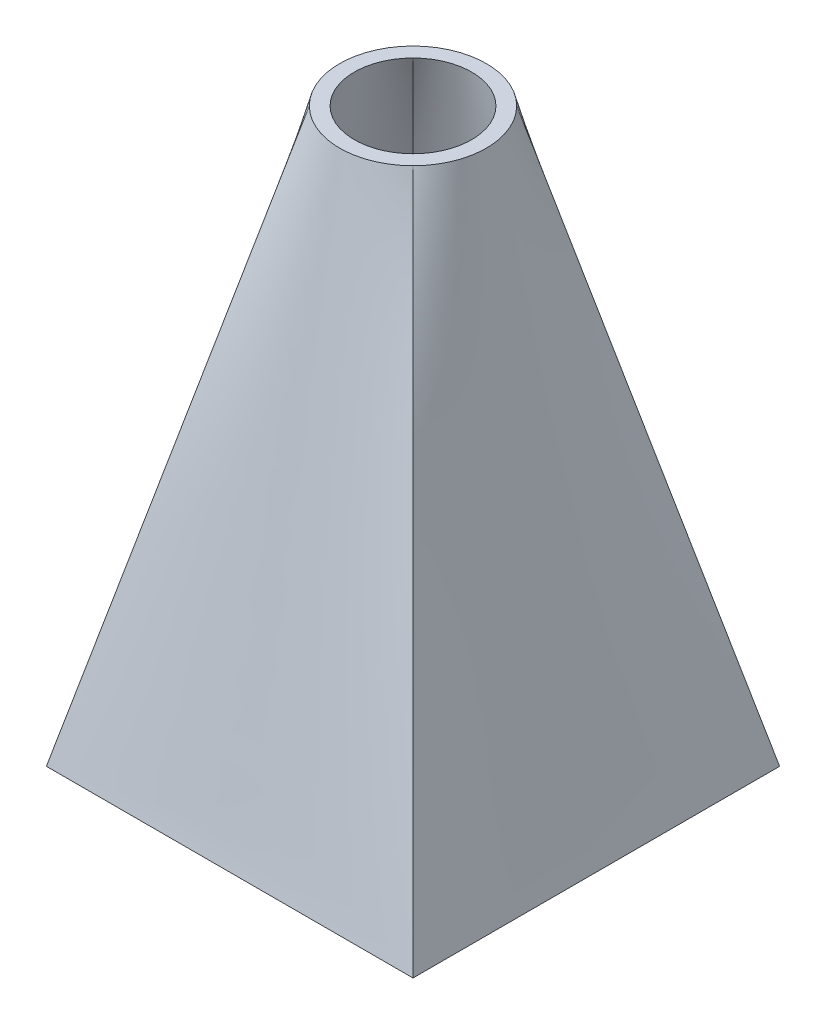
ISO-10303-21;
HEADER;
FILE_DESCRIPTION(('STEP AP214'),'2;1');
FILE_NAME('part.step','',(''),(''),'','','');
FILE_SCHEMA(('AUTOMOTIVE_DESIGN { 1 0 10303 214 1 1 1 1 }'));
ENDSEC;
DATA;
#1=APPLICATION_CONTEXT('core data for automotive mechanical design processes');
#2=APPLICATION_PROTOCOL_DEFINITION('international standard','automotive_design',2000,#1);
#3=PRODUCT_CONTEXT('',#1,'mechanical');
#4=PRODUCT('Part','Part','',(#3));
#5=PRODUCT_RELATED_PRODUCT_CATEGORY('part','',(#4));
#6=PRODUCT_DEFINITION_FORMATION('','',#4);
#7=PRODUCT_DEFINITION_CONTEXT('part definition',#1,'design');
#8=PRODUCT_DEFINITION('design','',#6,#7);
#9=PRODUCT_DEFINITION_SHAPE('','',#8);
#10=(LENGTH_UNIT() NAMED_UNIT(*) SI_UNIT(.MILLI.,.METRE.));
#11=(NAMED_UNIT(*) PLANE_ANGLE_UNIT() SI_UNIT($,.RADIAN.));
#12=(NAMED_UNIT(*) SI_UNIT($,.STERADIAN.) SOLID_ANGLE_UNIT());
#13=UNCERTAINTY_MEASURE_WITH_UNIT(LENGTH_MEASURE(1.E-05),#10,'distance_accuracy_value','');
#14=(GEOMETRIC_REPRESENTATION_CONTEXT(3) GLOBAL_UNCERTAINTY_ASSIGNED_CONTEXT((#13)) GLOBAL_UNIT_ASSIGNED_CONTEXT((#10,
#11,#12)) REPRESENTATION_CONTEXT('',''));
#15=CARTESIAN_POINT('',(0.,0.,0.));
#16=DIRECTION('',(0.,0.,1.));
#17=DIRECTION('',(1.,0.,0.));
#18=AXIS2_PLACEMENT_3D('',#15,#16,#17);
#19=CARTESIAN_POINT('',(0.,0.,0.));
#20=DIRECTION('',(0.,1.,0.));
#21=DIRECTION('',(0.,0.,1.));
#22=AXIS2_PLACEMENT_3D('',#19,#20,#21);
#23=PLANE('',#22);
#24=CARTESIAN_POINT('',(0.,0.,0.));
#25=DIRECTION('',(0.,1.,0.));
#26=DIRECTION('',(0.,0.,1.));
#27=AXIS2_PLACEMENT_3D('',#24,#25,#26);
#28=CIRCLE('',#27,4.);
#29=CARTESIAN_POINT('',(-2.82842712474619,0.,2.82842712474619));
#30=VERTEX_POINT('',#29);
#31=CARTESIAN_POINT('',(2.82842712474619,0.,2.82842712474619));
#32=VERTEX_POINT('',#31);
#33=EDGE_CURVE('E275',#30,#32,#28,.T.);
#34=ORIENTED_EDGE('',*,*,#33,.F.);
#35=CARTESIAN_POINT('',(-2.82842712474619,0.,-2.82842712474619));
#36=VERTEX_POINT('',#35);
#37=EDGE_CURVE('E294',#36,#30,#28,.T.);
#38=ORIENTED_EDGE('',*,*,#37,.F.);
#39=CARTESIAN_POINT('',(2.82842712474619,0.,-2.82842712474619));
#40=VERTEX_POINT('',#39);
#41=EDGE_CURVE('E253',#40,#36,#28,.T.);
#42=ORIENTED_EDGE('',*,*,#41,.F.);
#43=EDGE_CURVE('E93',#32,#40,#28,.T.);
#44=ORIENTED_EDGE('',*,*,#43,.F.);
#45=EDGE_LOOP('',(#34,#38,#42,#44));
#46=FACE_BOUND('',#45,.T.);
#47=CARTESIAN_POINT('',(0.,0.,0.));
#48=DIRECTION('',(0.,1.,0.));
#49=DIRECTION('',(0.,0.,1.));
#50=AXIS2_PLACEMENT_3D('',#47,#48,#49);
#51=CIRCLE('',#50,5.);
#52=CARTESIAN_POINT('',(3.53553390593274,0.,3.53553390593274));
#53=VERTEX_POINT('',#52);
#54=CARTESIAN_POINT('',(3.53553390593274,0.,-3.53553390593274));
#55=VERTEX_POINT('',#54);
#56=EDGE_CURVE('E12',#53,#55,#51,.T.);
#57=ORIENTED_EDGE('',*,*,#56,.T.);
#58=CARTESIAN_POINT('',(-3.53553390593274,0.,-3.53553390593274));
#59=VERTEX_POINT('',#58);
#60=EDGE_CURVE('E99',#55,#59,#51,.T.);
#61=ORIENTED_EDGE('',*,*,#60,.T.);
#62=CARTESIAN_POINT('',(-3.53553390593274,0.,3.53553390593274));
#63=VERTEX_POINT('',#62);
#64=EDGE_CURVE('E463',#59,#63,#51,.T.);
#65=ORIENTED_EDGE('',*,*,#64,.T.);
#66=EDGE_CURVE('E454',#63,#53,#51,.T.);
#67=ORIENTED_EDGE('',*,*,#66,.T.);
#68=EDGE_LOOP('',(#57,#61,#65,#67));
#69=FACE_BOUND('',#68,.T.);
#70=ADVANCED_FACE('F89',(#46,#69),#23,.T.);
#71=CARTESIAN_POINT('',(0.,-39.,0.));
#72=DIRECTION('',(0.,1.,0.));
#73=DIRECTION('',(0.,0.,1.));
#74=AXIS2_PLACEMENT_3D('',#71,#72,#73);
#75=PLANE('',#74);
#76=DIRECTION('',(0.,0.,1.));
#77=VECTOR('',#76,1.);
#78=CARTESIAN_POINT('',(-11.,-39.,-11.));
#79=LINE('',#78,#77);
#80=CARTESIAN_POINT('',(-11.,-39.,-11.));
#81=VERTEX_POINT('',#80);
#82=CARTESIAN_POINT('',(-11.,-39.,11.));
#83=VERTEX_POINT('',#82);
#84=EDGE_CURVE('E115',#81,#83,#79,.T.);
#85=ORIENTED_EDGE('',*,*,#84,.T.);
#86=DIRECTION('',(1.,0.,0.));
#87=VECTOR('',#86,1.);
#88=CARTESIAN_POINT('',(-11.,-39.,11.));
#89=LINE('',#88,#87);
#90=CARTESIAN_POINT('',(11.,-39.,11.));
#91=VERTEX_POINT('',#90);
#92=EDGE_CURVE('E182',#83,#91,#89,.T.);
#93=ORIENTED_EDGE('',*,*,#92,.T.);
#94=DIRECTION('',(0.,0.,-1.));
#95=VECTOR('',#94,1.);
#96=CARTESIAN_POINT('',(11.,-39.,-11.));
#97=LINE('',#96,#95);
#98=CARTESIAN_POINT('',(11.,-39.,-11.));
#99=VERTEX_POINT('',#98);
#100=EDGE_CURVE('E165',#91,#99,#97,.T.);
#101=ORIENTED_EDGE('',*,*,#100,.T.);
#102=DIRECTION('',(-1.,0.,0.));
#103=VECTOR('',#102,1.);
#104=CARTESIAN_POINT('',(-11.,-39.,-11.));
#105=LINE('',#104,#103);
#106=EDGE_CURVE('E157',#99,#81,#105,.T.);
#107=ORIENTED_EDGE('',*,*,#106,.T.);
#108=EDGE_LOOP('',(#85,#93,#101,#107));
#109=FACE_BOUND('',#108,.T.);
#110=DIRECTION('',(0.,0.,1.));
#111=VECTOR('',#110,1.);
#112=CARTESIAN_POINT('',(-12.5,-39.,-12.5));
#113=LINE('',#112,#111);
#114=CARTESIAN_POINT('',(-12.5,-39.,-12.5));
#115=VERTEX_POINT('',#114);
#116=CARTESIAN_POINT('',(-12.5,-39.,12.5));
#117=VERTEX_POINT('',#116);
#118=EDGE_CURVE('E368',#115,#117,#113,.T.);
#119=ORIENTED_EDGE('',*,*,#118,.F.);
#120=DIRECTION('',(1.,0.,0.));
#121=VECTOR('',#120,1.);
#122=CARTESIAN_POINT('',(-12.5,-39.,-12.5));
#123=LINE('',#122,#121);
#124=CARTESIAN_POINT('',(12.5,-39.,-12.5));
#125=VERTEX_POINT('',#124);
#126=EDGE_CURVE('E385',#115,#125,#123,.T.);
#127=ORIENTED_EDGE('',*,*,#126,.T.);
#128=DIRECTION('',(0.,0.,1.));
#129=VECTOR('',#128,1.);
#130=CARTESIAN_POINT('',(12.5,-39.,-12.5));
#131=LINE('',#130,#129);
#132=CARTESIAN_POINT('',(12.5,-39.,12.5));
#133=VERTEX_POINT('',#132);
#134=EDGE_CURVE('E378',#125,#133,#131,.T.);
#135=ORIENTED_EDGE('',*,*,#134,.T.);
#136=DIRECTION('',(1.,0.,0.));
#137=VECTOR('',#136,1.);
#138=CARTESIAN_POINT('',(-12.5,-39.,12.5));
#139=LINE('',#138,#137);
#140=EDGE_CURVE('E370',#117,#133,#139,.T.);
#141=ORIENTED_EDGE('',*,*,#140,.F.);
#142=EDGE_LOOP('',(#119,#127,#135,#141));
#143=FACE_BOUND('',#142,.T.);
#144=ADVANCED_FACE('F180',(#109,#143),#75,.F.);
#145=CARTESIAN_POINT('',(12.5,-39.,-12.5));
#146=CARTESIAN_POINT('',(3.53553390593274,0.,-3.53553390593274));
#147=CARTESIAN_POINT('',(10.4166666666667,-39.,-12.5));
#148=CARTESIAN_POINT('',(3.11886723926607,0.,-3.9522005725994));
#149=CARTESIAN_POINT('',(8.33333333333333,-39.,-12.5));
#150=CARTESIAN_POINT('',(2.59339721214962,0.,-4.32579298105229));
#151=CARTESIAN_POINT('',(5.20833333333333,-39.,-12.5));
#152=CARTESIAN_POINT('',(1.68213150016822,0.,-4.72016759446828));
#153=CARTESIAN_POINT('',(4.16666666666666,-39.,-12.5));
#154=CARTESIAN_POINT('',(1.35881651527707,0.,-4.82392482457469));
#155=CARTESIAN_POINT('',(2.08333333333333,-39.,-12.5));
#156=CARTESIAN_POINT('',(0.690278229276497,0.,-4.96388446697993));
#157=CARTESIAN_POINT('',(1.04166666666666,-39.,-12.5));
#158=CARTESIAN_POINT('',(0.345177968644245,0.,-5.));
#159=CARTESIAN_POINT('',(-1.04166666666667,-39.,-12.5));
#160=CARTESIAN_POINT('',(-0.345177968644246,0.,-5.));
#161=CARTESIAN_POINT('',(-2.08333333333334,-39.,-12.5));
#162=CARTESIAN_POINT('',(-0.690278229276498,0.,-4.96388446697993));
#163=CARTESIAN_POINT('',(-4.16666666666667,-39.,-12.5));
#164=CARTESIAN_POINT('',(-1.35881651527707,0.,-4.82392482457469));
#165=CARTESIAN_POINT('',(-5.20833333333334,-39.,-12.5));
#166=CARTESIAN_POINT('',(-1.68213150016822,0.,-4.72016759446828));
#167=CARTESIAN_POINT('',(-8.33333333333334,-39.,-12.5));
#168=CARTESIAN_POINT('',(-2.59339721214962,0.,-4.32579298105229));
#169=CARTESIAN_POINT('',(-10.4166666666667,-39.,-12.5));
#170=CARTESIAN_POINT('',(-3.11886723926607,0.,-3.95220057259941));
#171=CARTESIAN_POINT('',(-12.5,-39.,-12.5));
#172=CARTESIAN_POINT('',(-3.53553390593274,0.,-3.53553390593274));
#173=B_SPLINE_SURFACE_WITH_KNOTS('',3,1,((#145,#146),(#147,#148),(#149,#150),(#151,#152),(#153,
#154),(#155,#156),(#157,#158),(#159,#160),(#161,#162),(#163,#164),(#165,#166),(#167,#168),(#169,
#170),(#171,#172)),.UNSPECIFIED.,.F.,.F.,.F.,(4,2,2,2,2,2,4),(2,2),(0.,0.25,0.375,0.5,0.625,
0.75,1.),(0.,1.),.UNSPECIFIED.);
#174=DIRECTION('',(0.218598490006613,0.951014931709097,0.218598490006613));
#175=VECTOR('',#174,1.);
#176=CARTESIAN_POINT('',(-8.01776695296637,-19.5,-8.01776695296637));
#177=LINE('',#176,#175);
#178=EDGE_CURVE('E404',#115,#59,#177,.T.);
#179=DIRECTION('',(0.218598490006612,-0.951014931709097,-0.218598490006613));
#180=VECTOR('',#179,1.);
#181=CARTESIAN_POINT('',(8.01776695296636,-19.5,-8.01776695296637));
#182=LINE('',#181,#180);
#183=EDGE_CURVE('E390',#55,#125,#182,.T.);
#184=ORIENTED_EDGE('',*,*,#126,.F.);
#185=ORIENTED_EDGE('',*,*,#178,.T.);
#186=ORIENTED_EDGE('',*,*,#60,.F.);
#187=ORIENTED_EDGE('',*,*,#183,.T.);
#188=EDGE_LOOP('',(#184,#185,#186,#187));
#189=FACE_BOUND('',#188,.T.);
#190=ADVANCED_FACE('F203',(#189),#173,.T.);
#191=CARTESIAN_POINT('',(-12.5,-39.,-12.5));
#192=CARTESIAN_POINT('',(-3.53553390593274,0.,-3.53553390593274));
#193=CARTESIAN_POINT('',(-12.5,-39.,-10.4166666666667));
#194=CARTESIAN_POINT('',(-3.9522005725994,0.,-3.11886723926607));
#195=CARTESIAN_POINT('',(-12.5,-39.,-8.33333333333334));
#196=CARTESIAN_POINT('',(-4.32579298105229,0.,-2.59339721214962));
#197=CARTESIAN_POINT('',(-12.5,-39.,-5.20833333333334));
#198=CARTESIAN_POINT('',(-4.72016759446828,0.,-1.68213150016822));
#199=CARTESIAN_POINT('',(-12.5,-39.,-4.16666666666667));
#200=CARTESIAN_POINT('',(-4.82392482457469,0.,-1.35881651527707));
#201=CARTESIAN_POINT('',(-12.5,-39.,-2.08333333333334));
#202=CARTESIAN_POINT('',(-4.96388446697993,0.,-0.690278229276499));
#203=CARTESIAN_POINT('',(-12.5,-39.,-1.04166666666667));
#204=CARTESIAN_POINT('',(-5.,0.,-0.345177968644247));
#205=CARTESIAN_POINT('',(-12.5,-39.,1.04166666666666));
#206=CARTESIAN_POINT('',(-5.,0.,0.345177968644245));
#207=CARTESIAN_POINT('',(-12.5,-39.,2.08333333333333));
#208=CARTESIAN_POINT('',(-4.96388446697993,0.,0.690278229276497));
#209=CARTESIAN_POINT('',(-12.5,-39.,4.16666666666666));
#210=CARTESIAN_POINT('',(-4.82392482457469,0.,1.35881651527707));
#211=CARTESIAN_POINT('',(-12.5,-39.,5.20833333333333));
#212=CARTESIAN_POINT('',(-4.72016759446828,0.,1.68213150016822));
#213=CARTESIAN_POINT('',(-12.5,-39.,8.33333333333333));
#214=CARTESIAN_POINT('',(-4.32579298105229,0.,2.59339721214962));
#215=CARTESIAN_POINT('',(-12.5,-39.,10.4166666666667));
#216=CARTESIAN_POINT('',(-3.9522005725994,0.,3.11886723926607));
#217=CARTESIAN_POINT('',(-12.5,-39.,12.5));
#218=CARTESIAN_POINT('',(-3.53553390593274,0.,3.53553390593274));
#219=B_SPLINE_SURFACE_WITH_KNOTS('',3,1,((#191,#192),(#193,#194),(#195,#196),(#197,#198),(#199,
#200),(#201,#202),(#203,#204),(#205,#206),(#207,#208),(#209,#210),(#211,#212),(#213,#214),(#215,
#216),(#217,#218)),.UNSPECIFIED.,.F.,.F.,.F.,(4,2,2,2,2,2,4),(2,2),(0.,0.25,0.375,0.5,0.625,
0.75,1.),(0.,1.),.UNSPECIFIED.);
#220=DIRECTION('',(0.218598490006612,0.951014931709097,-0.218598490006613));
#221=VECTOR('',#220,1.);
#222=CARTESIAN_POINT('',(-8.01776695296637,-19.5,8.01776695296637));
#223=LINE('',#222,#221);
#224=EDGE_CURVE('E406',#117,#63,#223,.T.);
#225=ORIENTED_EDGE('',*,*,#118,.T.);
#226=ORIENTED_EDGE('',*,*,#224,.T.);
#227=ORIENTED_EDGE('',*,*,#64,.F.);
#228=ORIENTED_EDGE('',*,*,#178,.F.);
#229=EDGE_LOOP('',(#225,#226,#227,#228));
#230=FACE_BOUND('',#229,.T.);
#231=ADVANCED_FACE('F420',(#230),#219,.T.);
#232=CARTESIAN_POINT('',(12.5,-39.,12.5));
#233=CARTESIAN_POINT('',(3.53553390593274,0.,3.53553390593274));
#234=CARTESIAN_POINT('',(12.5,-39.,10.4166666666667));
#235=CARTESIAN_POINT('',(3.9522005725994,0.,3.11886723926607));
#236=CARTESIAN_POINT('',(12.5,-39.,8.33333333333333));
#237=CARTESIAN_POINT('',(4.32579298105229,0.,2.59339721214962));
#238=CARTESIAN_POINT('',(12.5,-39.,5.20833333333333));
#239=CARTESIAN_POINT('',(4.72016759446828,0.,1.68213150016822));
#240=CARTESIAN_POINT('',(12.5,-39.,4.16666666666666));
#241=CARTESIAN_POINT('',(4.82392482457469,0.,1.35881651527707));
#242=CARTESIAN_POINT('',(12.5,-39.,2.08333333333333));
#243=CARTESIAN_POINT('',(4.96388446697993,0.,0.690278229276497));
#244=CARTESIAN_POINT('',(12.5,-39.,1.04166666666667));
#245=CARTESIAN_POINT('',(5.,0.,0.345177968644246));
#246=CARTESIAN_POINT('',(12.5,-39.,-1.04166666666667));
#247=CARTESIAN_POINT('',(5.,0.,-0.345177968644246));
#248=CARTESIAN_POINT('',(12.5,-39.,-2.08333333333334));
#249=CARTESIAN_POINT('',(4.96388446697993,0.,-0.690278229276499));
#250=CARTESIAN_POINT('',(12.5,-39.,-4.16666666666667));
#251=CARTESIAN_POINT('',(4.82392482457469,0.,-1.35881651527707));
#252=CARTESIAN_POINT('',(12.5,-39.,-5.20833333333334));
#253=CARTESIAN_POINT('',(4.72016759446828,0.,-1.68213150016822));
#254=CARTESIAN_POINT('',(12.5,-39.,-8.33333333333334));
#255=CARTESIAN_POINT('',(4.32579298105229,0.,-2.59339721214962));
#256=CARTESIAN_POINT('',(12.5,-39.,-10.4166666666667));
#257=CARTESIAN_POINT('',(3.9522005725994,0.,-3.11886723926607));
#258=CARTESIAN_POINT('',(12.5,-39.,-12.5));
#259=CARTESIAN_POINT('',(3.53553390593274,0.,-3.53553390593274));
#260=B_SPLINE_SURFACE_WITH_KNOTS('',3,1,((#232,#233),(#234,#235),(#236,#237),(#238,#239),(#240,
#241),(#242,#243),(#244,#245),(#246,#247),(#248,#249),(#250,#251),(#252,#253),(#254,#255),(#256,
#257),(#258,#259)),.UNSPECIFIED.,.F.,.F.,.F.,(4,2,2,2,2,2,4),(2,2),(0.,0.25,0.375,0.5,0.625,
0.75,1.),(0.,1.),.UNSPECIFIED.);
#261=DIRECTION('',(-0.218598490006613,0.951014931709097,-0.218598490006613));
#262=VECTOR('',#261,1.);
#263=CARTESIAN_POINT('',(8.01776695296637,-19.5,8.01776695296637));
#264=LINE('',#263,#262);
#265=EDGE_CURVE('E398',#133,#53,#264,.T.);
#266=ORIENTED_EDGE('',*,*,#134,.F.);
#267=ORIENTED_EDGE('',*,*,#183,.F.);
#268=ORIENTED_EDGE('',*,*,#56,.F.);
#269=ORIENTED_EDGE('',*,*,#265,.F.);
#270=EDGE_LOOP('',(#266,#267,#268,#269));
#271=FACE_BOUND('',#270,.T.);
#272=ADVANCED_FACE('F396',(#271),#260,.T.);
#273=CARTESIAN_POINT('',(-12.5,-39.,12.5));
#274=CARTESIAN_POINT('',(-3.53553390593274,0.,3.53553390593274));
#275=CARTESIAN_POINT('',(-10.4166666666667,-39.,12.5));
#276=CARTESIAN_POINT('',(-3.11886723926607,0.,3.9522005725994));
#277=CARTESIAN_POINT('',(-8.33333333333333,-39.,12.5));
#278=CARTESIAN_POINT('',(-2.59339721214962,0.,4.32579298105229));
#279=CARTESIAN_POINT('',(-5.20833333333333,-39.,12.5));
#280=CARTESIAN_POINT('',(-1.68213150016822,0.,4.72016759446828));
#281=CARTESIAN_POINT('',(-4.16666666666667,-39.,12.5));
#282=CARTESIAN_POINT('',(-1.35881651527707,0.,4.82392482457469));
#283=CARTESIAN_POINT('',(-2.08333333333333,-39.,12.5));
#284=CARTESIAN_POINT('',(-0.690278229276499,0.,4.96388446697993));
#285=CARTESIAN_POINT('',(-1.04166666666667,-39.,12.5));
#286=CARTESIAN_POINT('',(-0.345177968644247,0.,5.));
#287=CARTESIAN_POINT('',(1.04166666666667,-39.,12.5));
#288=CARTESIAN_POINT('',(0.345177968644245,0.,5.));
#289=CARTESIAN_POINT('',(2.08333333333333,-39.,12.5));
#290=CARTESIAN_POINT('',(0.690278229276497,0.,4.96388446697993));
#291=CARTESIAN_POINT('',(4.16666666666667,-39.,12.5));
#292=CARTESIAN_POINT('',(1.35881651527707,0.,4.82392482457469));
#293=CARTESIAN_POINT('',(5.20833333333333,-39.,12.5));
#294=CARTESIAN_POINT('',(1.68213150016822,0.,4.72016759446828));
#295=CARTESIAN_POINT('',(8.33333333333333,-39.,12.5));
#296=CARTESIAN_POINT('',(2.59339721214962,0.,4.32579298105229));
#297=CARTESIAN_POINT('',(10.4166666666667,-39.,12.5));
#298=CARTESIAN_POINT('',(3.11886723926607,0.,3.9522005725994));
#299=CARTESIAN_POINT('',(12.5,-39.,12.5));
#300=CARTESIAN_POINT('',(3.53553390593274,0.,3.53553390593274));
#301=B_SPLINE_SURFACE_WITH_KNOTS('',3,1,((#273,#274),(#275,#276),(#277,#278),(#279,#280),(#281,
#282),(#283,#284),(#285,#286),(#287,#288),(#289,#290),(#291,#292),(#293,#294),(#295,#296),(#297,
#298),(#299,#300)),.UNSPECIFIED.,.F.,.F.,.F.,(4,2,2,2,2,2,4),(2,2),(0.,0.25,0.375,0.5,0.625,
0.75,1.),(0.,1.),.UNSPECIFIED.);
#302=ORIENTED_EDGE('',*,*,#140,.T.);
#303=ORIENTED_EDGE('',*,*,#265,.T.);
#304=ORIENTED_EDGE('',*,*,#66,.F.);
#305=ORIENTED_EDGE('',*,*,#224,.F.);
#306=EDGE_LOOP('',(#302,#303,#304,#305));
#307=FACE_BOUND('',#306,.T.);
#308=ADVANCED_FACE('F492',(#307),#301,.T.);
#309=CARTESIAN_POINT('',(-11.,-39.,11.));
#310=CARTESIAN_POINT('',(-2.82842712474619,0.,2.82842712474619));
#311=CARTESIAN_POINT('',(-9.16666666666667,-39.,11.));
#312=CARTESIAN_POINT('',(-2.49509379141286,0.,3.16176045807952));
#313=CARTESIAN_POINT('',(-7.33333333333334,-39.,11.));
#314=CARTESIAN_POINT('',(-2.0747177697197,0.,3.46063438484183));
#315=CARTESIAN_POINT('',(-3.66666666666667,-39.,11.));
#316=CARTESIAN_POINT('',(-1.10270101027287,0.,3.88130063915222));
#317=CARTESIAN_POINT('',(-1.83333333333334,-39.,11.));
#318=CARTESIAN_POINT('',(-0.552284749830794,0.,4.));
#319=CARTESIAN_POINT('',(1.83333333333333,-39.,11.));
#320=CARTESIAN_POINT('',(0.552284749830793,0.,4.));
#321=CARTESIAN_POINT('',(3.66666666666666,-39.,11.));
#322=CARTESIAN_POINT('',(1.10270101027287,0.,3.88130063915222));
#323=CARTESIAN_POINT('',(7.33333333333333,-39.,11.));
#324=CARTESIAN_POINT('',(2.0747177697197,0.,3.46063438484183));
#325=CARTESIAN_POINT('',(9.16666666666666,-39.,11.));
#326=CARTESIAN_POINT('',(2.49509379141286,0.,3.16176045807952));
#327=CARTESIAN_POINT('',(11.,-39.,11.));
#328=CARTESIAN_POINT('',(2.82842712474619,0.,2.82842712474619));
#329=B_SPLINE_SURFACE_WITH_KNOTS('',3,1,((#309,#310),(#311,#312),(#313,#314),(#315,#316),(#317,
#318),(#319,#320),(#321,#322),(#323,#324),(#325,#326),(#327,#328)),.UNSPECIFIED.,.F.,.F.,.F.,(4,
2,2,2,4),(2,2),(0.,0.25,0.5,0.75,1.),(0.,1.),.UNSPECIFIED.);
#330=DIRECTION('',(-0.200893467225357,-0.958792798081185,0.200893467225357));
#331=VECTOR('',#330,1.);
#332=CARTESIAN_POINT('',(-6.91421356237309,-19.5,6.91421356237309));
#333=LINE('',#332,#331);
#334=EDGE_CURVE('E164',#30,#83,#333,.T.);
#335=DIRECTION('',(-0.200893467225357,0.958792798081185,-0.200893467225357));
#336=VECTOR('',#335,1.);
#337=CARTESIAN_POINT('',(6.9142135623731,-19.5,6.91421356237309));
#338=LINE('',#337,#336);
#339=EDGE_CURVE('E176',#91,#32,#338,.T.);
#340=ORIENTED_EDGE('',*,*,#92,.F.);
#341=ORIENTED_EDGE('',*,*,#334,.F.);
#342=ORIENTED_EDGE('',*,*,#33,.T.);
#343=ORIENTED_EDGE('',*,*,#339,.F.);
#344=EDGE_LOOP('',(#340,#341,#342,#343));
#345=FACE_BOUND('',#344,.T.);
#346=ADVANCED_FACE('F502',(#345),#329,.F.);
#347=CARTESIAN_POINT('',(11.,-39.,11.));
#348=CARTESIAN_POINT('',(2.82842712474619,0.,2.82842712474619));
#349=CARTESIAN_POINT('',(11.,-39.,9.16666666666666));
#350=CARTESIAN_POINT('',(3.16176045807952,0.,2.49509379141286));
#351=CARTESIAN_POINT('',(11.,-39.,7.33333333333333));
#352=CARTESIAN_POINT('',(3.46063438484183,0.,2.0747177697197));
#353=CARTESIAN_POINT('',(11.,-39.,3.66666666666666));
#354=CARTESIAN_POINT('',(3.88130063915223,0.,1.10270101027287));
#355=CARTESIAN_POINT('',(11.,-39.,1.83333333333333));
#356=CARTESIAN_POINT('',(4.,0.,0.552284749830792));
#357=CARTESIAN_POINT('',(11.,-39.,-1.83333333333333));
#358=CARTESIAN_POINT('',(4.,0.,-0.552284749830794));
#359=CARTESIAN_POINT('',(11.,-39.,-3.66666666666667));
#360=CARTESIAN_POINT('',(3.88130063915222,0.,-1.10270101027287));
#361=CARTESIAN_POINT('',(11.,-39.,-7.33333333333333));
#362=CARTESIAN_POINT('',(3.46063438484183,0.,-2.0747177697197));
#363=CARTESIAN_POINT('',(11.,-39.,-9.16666666666667));
#364=CARTESIAN_POINT('',(3.16176045807952,0.,-2.49509379141286));
#365=CARTESIAN_POINT('',(11.,-39.,-11.));
#366=CARTESIAN_POINT('',(2.82842712474619,0.,-2.82842712474619));
#367=B_SPLINE_SURFACE_WITH_KNOTS('',3,1,((#347,#348),(#349,#350),(#351,#352),(#353,#354),(#355,
#356),(#357,#358),(#359,#360),(#361,#362),(#363,#364),(#365,#366)),.UNSPECIFIED.,.F.,.F.,.F.,(4,
2,2,2,4),(2,2),(0.,0.25,0.5,0.75,1.),(0.,1.),.UNSPECIFIED.);
#368=DIRECTION('',(-0.200893467225357,0.958792798081185,0.200893467225357));
#369=VECTOR('',#368,1.);
#370=CARTESIAN_POINT('',(6.91421356237309,-19.5,-6.91421356237309));
#371=LINE('',#370,#369);
#372=EDGE_CURVE('E107',#99,#40,#371,.T.);
#373=ORIENTED_EDGE('',*,*,#100,.F.);
#374=ORIENTED_EDGE('',*,*,#339,.T.);
#375=ORIENTED_EDGE('',*,*,#43,.T.);
#376=ORIENTED_EDGE('',*,*,#372,.F.);
#377=EDGE_LOOP('',(#373,#374,#375,#376));
#378=FACE_BOUND('',#377,.T.);
#379=ADVANCED_FACE('F169',(#378),#367,.F.);
#380=CARTESIAN_POINT('',(-11.,-39.,-11.));
#381=CARTESIAN_POINT('',(-2.82842712474619,0.,-2.82842712474619));
#382=CARTESIAN_POINT('',(-11.,-39.,-9.16666666666667));
#383=CARTESIAN_POINT('',(-3.16176045807952,0.,-2.49509379141286));
#384=CARTESIAN_POINT('',(-11.,-39.,-7.33333333333333));
#385=CARTESIAN_POINT('',(-3.46063438484183,0.,-2.0747177697197));
#386=CARTESIAN_POINT('',(-11.,-39.,-3.66666666666666));
#387=CARTESIAN_POINT('',(-3.88130063915222,0.,-1.10270101027287));
#388=CARTESIAN_POINT('',(-11.,-39.,-1.83333333333333));
#389=CARTESIAN_POINT('',(-4.,0.,-0.552284749830794));
#390=CARTESIAN_POINT('',(-11.,-39.,1.83333333333333));
#391=CARTESIAN_POINT('',(-4.,0.,0.552284749830792));
#392=CARTESIAN_POINT('',(-11.,-39.,3.66666666666667));
#393=CARTESIAN_POINT('',(-3.88130063915222,0.,1.10270101027287));
#394=CARTESIAN_POINT('',(-11.,-39.,7.33333333333333));
#395=CARTESIAN_POINT('',(-3.46063438484183,0.,2.0747177697197));
#396=CARTESIAN_POINT('',(-11.,-39.,9.16666666666667));
#397=CARTESIAN_POINT('',(-3.16176045807952,0.,2.49509379141286));
#398=CARTESIAN_POINT('',(-11.,-39.,11.));
#399=CARTESIAN_POINT('',(-2.82842712474619,0.,2.82842712474619));
#400=B_SPLINE_SURFACE_WITH_KNOTS('',3,1,((#380,#381),(#382,#383),(#384,#385),(#386,#387),(#388,
#389),(#390,#391),(#392,#393),(#394,#395),(#396,#397),(#398,#399)),.UNSPECIFIED.,.F.,.F.,.F.,(4,
2,2,2,4),(2,2),(0.,0.25,0.5,0.75,1.),(0.,1.),.UNSPECIFIED.);
#401=DIRECTION('',(0.200893467225357,0.958792798081185,0.200893467225357));
#402=VECTOR('',#401,1.);
#403=CARTESIAN_POINT('',(-6.91421356237309,-19.5,-6.91421356237309));
#404=LINE('',#403,#402);
#405=EDGE_CURVE('E160',#81,#36,#404,.T.);
#406=ORIENTED_EDGE('',*,*,#84,.F.);
#407=ORIENTED_EDGE('',*,*,#405,.T.);
#408=ORIENTED_EDGE('',*,*,#37,.T.);
#409=ORIENTED_EDGE('',*,*,#334,.T.);
#410=EDGE_LOOP('',(#406,#407,#408,#409));
#411=FACE_BOUND('',#410,.T.);
#412=ADVANCED_FACE('F322',(#411),#400,.F.);
#413=CARTESIAN_POINT('',(11.,-39.,-11.));
#414=CARTESIAN_POINT('',(2.82842712474619,0.,-2.82842712474619));
#415=CARTESIAN_POINT('',(9.16666666666667,-39.,-11.));
#416=CARTESIAN_POINT('',(2.49509379141286,0.,-3.16176045807952));
#417=CARTESIAN_POINT('',(7.33333333333334,-39.,-11.));
#418=CARTESIAN_POINT('',(2.0747177697197,0.,-3.46063438484183));
#419=CARTESIAN_POINT('',(3.66666666666668,-39.,-11.));
#420=CARTESIAN_POINT('',(1.10270101027287,0.,-3.88130063915222));
#421=CARTESIAN_POINT('',(1.83333333333335,-39.,-11.));
#422=CARTESIAN_POINT('',(0.552284749830793,0.,-4.));
#423=CARTESIAN_POINT('',(-1.83333333333332,-39.,-11.));
#424=CARTESIAN_POINT('',(-0.552284749830794,0.,-4.));
#425=CARTESIAN_POINT('',(-3.66666666666665,-39.,-11.));
#426=CARTESIAN_POINT('',(-1.10270101027287,0.,-3.88130063915222));
#427=CARTESIAN_POINT('',(-7.33333333333332,-39.,-11.));
#428=CARTESIAN_POINT('',(-2.0747177697197,0.,-3.46063438484183));
#429=CARTESIAN_POINT('',(-9.16666666666666,-39.,-11.));
#430=CARTESIAN_POINT('',(-2.49509379141286,0.,-3.16176045807952));
#431=CARTESIAN_POINT('',(-11.,-39.,-11.));
#432=CARTESIAN_POINT('',(-2.82842712474619,0.,-2.82842712474619));
#433=B_SPLINE_SURFACE_WITH_KNOTS('',3,1,((#413,#414),(#415,#416),(#417,#418),(#419,#420),(#421,
#422),(#423,#424),(#425,#426),(#427,#428),(#429,#430),(#431,#432)),.UNSPECIFIED.,.F.,.F.,.F.,(4,
2,2,2,4),(2,2),(0.,0.25,0.5,0.75,1.),(0.,1.),.UNSPECIFIED.);
#434=ORIENTED_EDGE('',*,*,#106,.F.);
#435=ORIENTED_EDGE('',*,*,#372,.T.);
#436=ORIENTED_EDGE('',*,*,#41,.T.);
#437=ORIENTED_EDGE('',*,*,#405,.F.);
#438=EDGE_LOOP('',(#434,#435,#436,#437));
#439=FACE_BOUND('',#438,.T.);
#440=ADVANCED_FACE('F159',(#439),#433,.F.);
#441=CLOSED_SHELL('',(#70,#144,#190,#231,#272,#308,#346,#379,#412,#440));
#442=MANIFOLD_SOLID_BREP('B2',#441);
#443=ADVANCED_BREP_SHAPE_REPRESENTATION('',(#18,#442),#14);
#444=SHAPE_DEFINITION_REPRESENTATION(#9,#443);
ENDSEC;
END-ISO-10303-21;
